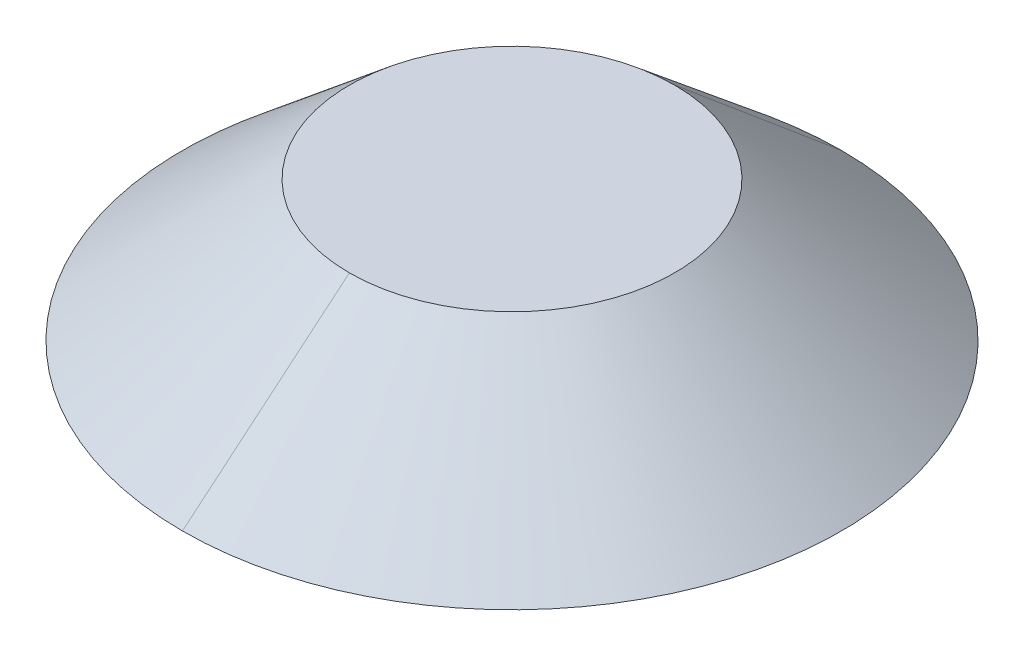
ISO-10303-21;
HEADER;
FILE_DESCRIPTION(('STEP AP214'),'2;1');
FILE_NAME('part.step','',(''),(''),'','','');
FILE_SCHEMA(('AUTOMOTIVE_DESIGN { 1 0 10303 214 1 1 1 1 }'));
ENDSEC;
DATA;
#1=APPLICATION_CONTEXT('core data for automotive mechanical design processes');
#2=APPLICATION_PROTOCOL_DEFINITION('international standard','automotive_design',2000,#1);
#3=PRODUCT_CONTEXT('',#1,'mechanical');
#4=PRODUCT('Part','Part','',(#3));
#5=PRODUCT_RELATED_PRODUCT_CATEGORY('part','',(#4));
#6=PRODUCT_DEFINITION_FORMATION('','',#4);
#7=PRODUCT_DEFINITION_CONTEXT('part definition',#1,'design');
#8=PRODUCT_DEFINITION('design','',#6,#7);
#9=PRODUCT_DEFINITION_SHAPE('','',#8);
#10=(LENGTH_UNIT() NAMED_UNIT(*) SI_UNIT(.MILLI.,.METRE.));
#11=(NAMED_UNIT(*) PLANE_ANGLE_UNIT() SI_UNIT($,.RADIAN.));
#12=(NAMED_UNIT(*) SI_UNIT($,.STERADIAN.) SOLID_ANGLE_UNIT());
#13=UNCERTAINTY_MEASURE_WITH_UNIT(LENGTH_MEASURE(1.E-05),#10,'distance_accuracy_value','');
#14=(GEOMETRIC_REPRESENTATION_CONTEXT(3) GLOBAL_UNCERTAINTY_ASSIGNED_CONTEXT((#13)) GLOBAL_UNIT_ASSIGNED_CONTEXT((#10,
#11,#12)) REPRESENTATION_CONTEXT('',''));
#15=CARTESIAN_POINT('',(0.,0.,0.));
#16=DIRECTION('',(0.,0.,1.));
#17=DIRECTION('',(1.,0.,0.));
#18=AXIS2_PLACEMENT_3D('',#15,#16,#17);
#19=CARTESIAN_POINT('',(0.,0.117222218475467,0.));
#20=DIRECTION('',(0.,-1.,0.));
#21=DIRECTION('',(0.,0.,-1.));
#22=AXIS2_PLACEMENT_3D('',#19,#20,#21);
#23=PLANE('',#22);
#24=CARTESIAN_POINT('',(0.,0.117222218475467,0.));
#25=DIRECTION('',(0.,-1.,0.));
#26=DIRECTION('',(0.,0.,-1.));
#27=AXIS2_PLACEMENT_3D('',#24,#25,#26);
#28=CIRCLE('',#27,2.413);
#29=CARTESIAN_POINT('',(0.,0.117222218475468,2.413));
#30=VERTEX_POINT('',#29);
#31=CARTESIAN_POINT('',(0.,0.117222218475467,-2.413));
#32=VERTEX_POINT('',#31);
#33=EDGE_CURVE('E11',#30,#32,#28,.T.);
#34=ORIENTED_EDGE('',*,*,#33,.F.);
#35=CARTESIAN_POINT('',(0.,0.117222218475467,0.));
#36=DIRECTION('',(0.,-1.,0.));
#37=DIRECTION('',(0.,0.,-1.));
#38=AXIS2_PLACEMENT_3D('',#35,#36,#37);
#39=CIRCLE('',#38,2.413);
#40=EDGE_CURVE('E25',#32,#30,#39,.T.);
#41=ORIENTED_EDGE('',*,*,#40,.F.);
#42=EDGE_LOOP('',(#34,#41));
#43=FACE_BOUND('',#42,.T.);
#44=ADVANCED_FACE('F17',(#43),#23,.F.);
#45=CARTESIAN_POINT('',(0.,0.117222218475467,0.));
#46=DIRECTION('',(0.,-1.,0.));
#47=DIRECTION('',(-1.,0.,0.));
#48=AXIS2_PLACEMENT_3D('',#45,#46,#47);
#49=CONICAL_SURFACE('',#48,2.413,0.872664625997163);
#50=DIRECTION('',(0.,-0.642787609686541,0.766044443118977));
#51=VECTOR('',#50,1.);
#52=CARTESIAN_POINT('',(0.,0.117222218475468,2.413));
#53=LINE('',#52,#51);
#54=CARTESIAN_POINT('',(0.,-1.96080801813507,4.8895));
#55=VERTEX_POINT('',#54);
#56=EDGE_CURVE('E282',#30,#55,#53,.T.);
#57=ORIENTED_EDGE('',*,*,#56,.T.);
#58=CARTESIAN_POINT('',(0.,-1.96080801813508,0.));
#59=DIRECTION('',(0.,-1.,0.));
#60=DIRECTION('',(0.,0.,-1.));
#61=AXIS2_PLACEMENT_3D('',#58,#59,#60);
#62=CIRCLE('',#61,4.8895);
#63=CARTESIAN_POINT('',(0.,-1.96080801813508,-4.8895));
#64=VERTEX_POINT('',#63);
#65=EDGE_CURVE('E277',#64,#55,#62,.T.);
#66=ORIENTED_EDGE('',*,*,#65,.F.);
#67=DIRECTION('',(0.,-0.642787609686541,-0.766044443118977));
#68=VECTOR('',#67,1.);
#69=CARTESIAN_POINT('',(0.,0.117222218475468,-2.413));
#70=LINE('',#69,#68);
#71=EDGE_CURVE('E272',#32,#64,#70,.T.);
#72=ORIENTED_EDGE('',*,*,#71,.F.);
#73=ORIENTED_EDGE('',*,*,#40,.T.);
#74=EDGE_LOOP('',(#57,#66,#72,#73));
#75=FACE_BOUND('',#74,.T.);
#76=ADVANCED_FACE('F291',(#75),#49,.T.);
#77=CARTESIAN_POINT('',(0.,0.117222218475467,0.));
#78=DIRECTION('',(0.,-1.,0.));
#79=DIRECTION('',(1.,0.,0.));
#80=AXIS2_PLACEMENT_3D('',#77,#78,#79);
#81=CONICAL_SURFACE('',#80,2.413,0.872664625997163);
#82=ORIENTED_EDGE('',*,*,#56,.F.);
#83=ORIENTED_EDGE('',*,*,#33,.T.);
#84=ORIENTED_EDGE('',*,*,#71,.T.);
#85=CARTESIAN_POINT('',(0.,-1.96080801813508,0.));
#86=DIRECTION('',(0.,-1.,0.));
#87=DIRECTION('',(0.,0.,-1.));
#88=AXIS2_PLACEMENT_3D('',#85,#86,#87);
#89=CIRCLE('',#88,4.8895);
#90=EDGE_CURVE('E267',#55,#64,#89,.T.);
#91=ORIENTED_EDGE('',*,*,#90,.F.);
#92=EDGE_LOOP('',(#82,#83,#84,#91));
#93=FACE_BOUND('',#92,.T.);
#94=ADVANCED_FACE('F294',(#93),#81,.T.);
#95=CARTESIAN_POINT('',(4.8895,-1.96080801813508,0.));
#96=DIRECTION('',(0.,1.,0.));
#97=DIRECTION('',(0.,0.,1.));
#98=AXIS2_PLACEMENT_3D('',#95,#96,#97);
#99=PLANE('',#98);
#100=DIRECTION('',(0.,0.,-1.));
#101=VECTOR('',#100,1.);
#102=CARTESIAN_POINT('',(2.58826,-1.96080801813508,0.));
#103=LINE('',#102,#101);
#104=CARTESIAN_POINT('',(2.58826,-1.96080801813508,0.52832));
#105=VERTEX_POINT('',#104);
#106=CARTESIAN_POINT('',(2.58826,-1.96080801813508,-0.52832));
#107=VERTEX_POINT('',#106);
#108=EDGE_CURVE('E263',#105,#107,#103,.T.);
#109=ORIENTED_EDGE('',*,*,#108,.T.);
#110=DIRECTION('',(1.,0.,0.));
#111=VECTOR('',#110,1.);
#112=CARTESIAN_POINT('',(0.78232,-1.96080801813508,-0.52832));
#113=LINE('',#112,#111);
#114=CARTESIAN_POINT('',(0.78232,-1.96080801813508,-0.52832));
#115=VERTEX_POINT('',#114);
#116=EDGE_CURVE('E258',#115,#107,#113,.T.);
#117=ORIENTED_EDGE('',*,*,#116,.F.);
#118=CARTESIAN_POINT('',(0.782320000000041,-1.96080801813508,-0.782320000000041));
#119=DIRECTION('',(0.,-1.,0.));
#120=DIRECTION('',(1.,0.,0.));
#121=AXIS2_PLACEMENT_3D('',#118,#119,#120);
#122=CIRCLE('',#121,0.254000000000041);
#123=CARTESIAN_POINT('',(0.52832,-1.96080801813508,-0.78232));
#124=VERTEX_POINT('',#123);
#125=EDGE_CURVE('E254',#115,#124,#122,.T.);
#126=ORIENTED_EDGE('',*,*,#125,.T.);
#127=DIRECTION('',(0.,0.,1.));
#128=VECTOR('',#127,1.);
#129=CARTESIAN_POINT('',(0.52832,-1.96080801813508,-2.58826));
#130=LINE('',#129,#128);
#131=CARTESIAN_POINT('',(0.52832,-1.96080801813508,-2.58826));
#132=VERTEX_POINT('',#131);
#133=EDGE_CURVE('E249',#132,#124,#130,.T.);
#134=ORIENTED_EDGE('',*,*,#133,.F.);
#135=DIRECTION('',(1.,0.,0.));
#136=VECTOR('',#135,1.);
#137=CARTESIAN_POINT('',(-0.52832,-1.96080801813508,-2.58826));
#138=LINE('',#137,#136);
#139=CARTESIAN_POINT('',(-0.52832,-1.96080801813508,-2.58826));
#140=VERTEX_POINT('',#139);
#141=EDGE_CURVE('E244',#140,#132,#138,.T.);
#142=ORIENTED_EDGE('',*,*,#141,.F.);
#143=DIRECTION('',(0.,0.,-1.));
#144=VECTOR('',#143,1.);
#145=CARTESIAN_POINT('',(-0.52832,-1.96080801813508,-0.78232));
#146=LINE('',#145,#144);
#147=CARTESIAN_POINT('',(-0.52832,-1.96080801813508,-0.78232));
#148=VERTEX_POINT('',#147);
#149=EDGE_CURVE('E239',#148,#140,#146,.T.);
#150=ORIENTED_EDGE('',*,*,#149,.F.);
#151=CARTESIAN_POINT('',(-0.782320000000041,-1.96080801813508,-0.782320000000041));
#152=DIRECTION('',(0.,-1.,0.));
#153=DIRECTION('',(1.,0.,0.));
#154=AXIS2_PLACEMENT_3D('',#151,#152,#153);
#155=CIRCLE('',#154,0.254000000000041);
#156=CARTESIAN_POINT('',(-0.78232,-1.96080801813508,-0.52832));
#157=VERTEX_POINT('',#156);
#158=EDGE_CURVE('E235',#148,#157,#155,.T.);
#159=ORIENTED_EDGE('',*,*,#158,.T.);
#160=DIRECTION('',(1.,0.,0.));
#161=VECTOR('',#160,1.);
#162=CARTESIAN_POINT('',(-2.58826,-1.96080801813508,-0.52832));
#163=LINE('',#162,#161);
#164=CARTESIAN_POINT('',(-2.58826,-1.96080801813508,-0.52832));
#165=VERTEX_POINT('',#164);
#166=EDGE_CURVE('E230',#165,#157,#163,.T.);
#167=ORIENTED_EDGE('',*,*,#166,.F.);
#168=DIRECTION('',(0.,0.,-1.));
#169=VECTOR('',#168,1.);
#170=CARTESIAN_POINT('',(-2.58826,-1.96080801813508,0.52832));
#171=LINE('',#170,#169);
#172=CARTESIAN_POINT('',(-2.58826,-1.96080801813508,0.52832));
#173=VERTEX_POINT('',#172);
#174=EDGE_CURVE('E225',#173,#165,#171,.T.);
#175=ORIENTED_EDGE('',*,*,#174,.F.);
#176=DIRECTION('',(-1.,0.,0.));
#177=VECTOR('',#176,1.);
#178=CARTESIAN_POINT('',(-0.78232,-1.96080801813508,0.52832));
#179=LINE('',#178,#177);
#180=CARTESIAN_POINT('',(-0.78232,-1.96080801813508,0.52832));
#181=VERTEX_POINT('',#180);
#182=EDGE_CURVE('E221',#181,#173,#179,.T.);
#183=ORIENTED_EDGE('',*,*,#182,.F.);
#184=CARTESIAN_POINT('',(-0.782320000000041,-1.96080801813508,0.782320000000041));
#185=DIRECTION('',(0.,-1.,0.));
#186=DIRECTION('',(1.,0.,0.));
#187=AXIS2_PLACEMENT_3D('',#184,#185,#186);
#188=CIRCLE('',#187,0.254000000000041);
#189=CARTESIAN_POINT('',(-0.52832,-1.96080801813508,0.78232));
#190=VERTEX_POINT('',#189);
#191=EDGE_CURVE('E153',#181,#190,#188,.T.);
#192=ORIENTED_EDGE('',*,*,#191,.T.);
#193=DIRECTION('',(0.,0.,-1.));
#194=VECTOR('',#193,1.);
#195=CARTESIAN_POINT('',(-0.52832,-1.96080801813508,2.58826));
#196=LINE('',#195,#194);
#197=CARTESIAN_POINT('',(-0.52832,-1.96080801813508,2.58826));
#198=VERTEX_POINT('',#197);
#199=EDGE_CURVE('E213',#198,#190,#196,.T.);
#200=ORIENTED_EDGE('',*,*,#199,.F.);
#201=DIRECTION('',(-1.,0.,0.));
#202=VECTOR('',#201,1.);
#203=CARTESIAN_POINT('',(0.52832,-1.96080801813508,2.58826));
#204=LINE('',#203,#202);
#205=CARTESIAN_POINT('',(0.52832,-1.96080801813508,2.58826));
#206=VERTEX_POINT('',#205);
#207=EDGE_CURVE('E208',#206,#198,#204,.T.);
#208=ORIENTED_EDGE('',*,*,#207,.F.);
#209=DIRECTION('',(0.,0.,1.));
#210=VECTOR('',#209,1.);
#211=CARTESIAN_POINT('',(0.52832,-1.96080801813508,0.78232));
#212=LINE('',#211,#210);
#213=CARTESIAN_POINT('',(0.52832,-1.96080801813508,0.78232));
#214=VERTEX_POINT('',#213);
#215=EDGE_CURVE('E203',#214,#206,#212,.T.);
#216=ORIENTED_EDGE('',*,*,#215,.F.);
#217=CARTESIAN_POINT('',(0.782320000000041,-1.96080801813508,0.782320000000041));
#218=DIRECTION('',(0.,-1.,0.));
#219=DIRECTION('',(1.,0.,0.));
#220=AXIS2_PLACEMENT_3D('',#217,#218,#219);
#221=CIRCLE('',#220,0.254000000000041);
#222=CARTESIAN_POINT('',(0.78232,-1.96080801813508,0.52832));
#223=VERTEX_POINT('',#222);
#224=EDGE_CURVE('E199',#214,#223,#221,.T.);
#225=ORIENTED_EDGE('',*,*,#224,.T.);
#226=DIRECTION('',(-1.,0.,0.));
#227=VECTOR('',#226,1.);
#228=CARTESIAN_POINT('',(2.58826,-1.96080801813508,0.52832));
#229=LINE('',#228,#227);
#230=EDGE_CURVE('E194',#105,#223,#229,.T.);
#231=ORIENTED_EDGE('',*,*,#230,.F.);
#232=EDGE_LOOP('',(#109,#117,#126,#134,#142,#150,#159,#167,#175,#183,#192,#200,#208,#216,#225,#231));
#233=FACE_BOUND('',#232,.T.);
#234=ORIENTED_EDGE('',*,*,#65,.T.);
#235=ORIENTED_EDGE('',*,*,#90,.T.);
#236=EDGE_LOOP('',(#234,#235));
#237=FACE_BOUND('',#236,.T.);
#238=ADVANCED_FACE('F296',(#233,#237),#99,.F.);
#239=CARTESIAN_POINT('',(2.58826,-1.04132801813507,0.52832));
#240=DIRECTION('',(0.,0.,1.));
#241=DIRECTION('',(1.,0.,0.));
#242=AXIS2_PLACEMENT_3D('',#239,#240,#241);
#243=PLANE('',#242);
#244=ORIENTED_EDGE('',*,*,#230,.T.);
#245=DIRECTION('',(0.,-1.,0.));
#246=VECTOR('',#245,1.);
#247=CARTESIAN_POINT('',(0.78232,-1.04132801813507,0.52832));
#248=LINE('',#247,#246);
#249=CARTESIAN_POINT('',(0.78232,-1.04132801813507,0.52832));
#250=VERTEX_POINT('',#249);
#251=EDGE_CURVE('E189',#250,#223,#248,.T.);
#252=ORIENTED_EDGE('',*,*,#251,.F.);
#253=DIRECTION('',(-1.,0.,0.));
#254=VECTOR('',#253,1.);
#255=CARTESIAN_POINT('',(2.58826,-1.04132801813507,0.52832));
#256=LINE('',#255,#254);
#257=CARTESIAN_POINT('',(2.58826,-1.04132801813507,0.52832));
#258=VERTEX_POINT('',#257);
#259=EDGE_CURVE('E184',#258,#250,#256,.T.);
#260=ORIENTED_EDGE('',*,*,#259,.F.);
#261=DIRECTION('',(0.,-1.,0.));
#262=VECTOR('',#261,1.);
#263=CARTESIAN_POINT('',(2.58826,-1.04132801813507,0.52832));
#264=LINE('',#263,#262);
#265=EDGE_CURVE('E179',#258,#105,#264,.T.);
#266=ORIENTED_EDGE('',*,*,#265,.T.);
#267=EDGE_LOOP('',(#244,#252,#260,#266));
#268=FACE_BOUND('',#267,.T.);
#269=ADVANCED_FACE('F298',(#268),#243,.F.);
#270=CARTESIAN_POINT('',(2.58826,-1.04132801813507,-0.52832));
#271=DIRECTION('',(1.,0.,0.));
#272=DIRECTION('',(0.,0.,-1.));
#273=AXIS2_PLACEMENT_3D('',#270,#271,#272);
#274=PLANE('',#273);
#275=DIRECTION('',(0.,-1.,0.));
#276=VECTOR('',#275,1.);
#277=CARTESIAN_POINT('',(2.58826,-1.04132801813507,-0.52832));
#278=LINE('',#277,#276);
#279=CARTESIAN_POINT('',(2.58826,-1.04132801813507,-0.52832));
#280=VERTEX_POINT('',#279);
#281=EDGE_CURVE('E166',#280,#107,#278,.T.);
#282=ORIENTED_EDGE('',*,*,#281,.T.);
#283=ORIENTED_EDGE('',*,*,#108,.F.);
#284=ORIENTED_EDGE('',*,*,#265,.F.);
#285=DIRECTION('',(0.,0.,1.));
#286=VECTOR('',#285,1.);
#287=CARTESIAN_POINT('',(2.58826,-1.04132801813507,-0.52832));
#288=LINE('',#287,#286);
#289=EDGE_CURVE('E162',#280,#258,#288,.T.);
#290=ORIENTED_EDGE('',*,*,#289,.F.);
#291=EDGE_LOOP('',(#282,#283,#284,#290));
#292=FACE_BOUND('',#291,.T.);
#293=ADVANCED_FACE('F306',(#292),#274,.F.);
#294=CARTESIAN_POINT('',(-0.782320000000041,-1.04132801813507,-0.782320000000041));
#295=DIRECTION('',(0.,-1.,0.));
#296=DIRECTION('',(0.,0.,-1.));
#297=AXIS2_PLACEMENT_3D('',#294,#295,#296);
#298=PLANE('',#297);
#299=DIRECTION('',(-1.,0.,0.));
#300=VECTOR('',#299,1.);
#301=CARTESIAN_POINT('',(-0.78232,-1.04132801813507,0.52832));
#302=LINE('',#301,#300);
#303=CARTESIAN_POINT('',(-0.78232,-1.04132801813507,0.52832));
#304=VERTEX_POINT('',#303);
#305=CARTESIAN_POINT('',(-2.58826,-1.04132801813507,0.52832));
#306=VERTEX_POINT('',#305);
#307=EDGE_CURVE('E141',#304,#306,#302,.T.);
#308=ORIENTED_EDGE('',*,*,#307,.T.);
#309=DIRECTION('',(0.,0.,-1.));
#310=VECTOR('',#309,1.);
#311=CARTESIAN_POINT('',(-2.58826,-1.04132801813507,0.52832));
#312=LINE('',#311,#310);
#313=CARTESIAN_POINT('',(-2.58826,-1.04132801813507,-0.52832));
#314=VERTEX_POINT('',#313);
#315=EDGE_CURVE('E163',#306,#314,#312,.T.);
#316=ORIENTED_EDGE('',*,*,#315,.T.);
#317=DIRECTION('',(1.,0.,0.));
#318=VECTOR('',#317,1.);
#319=CARTESIAN_POINT('',(-2.58826,-1.04132801813507,-0.52832));
#320=LINE('',#319,#318);
#321=CARTESIAN_POINT('',(-0.78232,-1.04132801813507,-0.52832));
#322=VERTEX_POINT('',#321);
#323=EDGE_CURVE('E168',#314,#322,#320,.T.);
#324=ORIENTED_EDGE('',*,*,#323,.T.);
#325=CARTESIAN_POINT('',(-0.782320000000041,-1.04132801813507,-0.782320000000041));
#326=DIRECTION('',(0.,-1.,0.));
#327=DIRECTION('',(1.,0.,0.));
#328=AXIS2_PLACEMENT_3D('',#325,#326,#327);
#329=CIRCLE('',#328,0.254000000000041);
#330=CARTESIAN_POINT('',(-0.52832,-1.04132801813507,-0.78232));
#331=VERTEX_POINT('',#330);
#332=EDGE_CURVE('E580',#331,#322,#329,.T.);
#333=ORIENTED_EDGE('',*,*,#332,.F.);
#334=DIRECTION('',(0.,0.,-1.));
#335=VECTOR('',#334,1.);
#336=CARTESIAN_POINT('',(-0.52832,-1.04132801813507,-0.78232));
#337=LINE('',#336,#335);
#338=CARTESIAN_POINT('',(-0.52832,-1.04132801813507,-2.58826));
#339=VERTEX_POINT('',#338);
#340=EDGE_CURVE('E576',#331,#339,#337,.T.);
#341=ORIENTED_EDGE('',*,*,#340,.T.);
#342=DIRECTION('',(1.,0.,0.));
#343=VECTOR('',#342,1.);
#344=CARTESIAN_POINT('',(-0.52832,-1.04132801813507,-2.58826));
#345=LINE('',#344,#343);
#346=CARTESIAN_POINT('',(0.52832,-1.04132801813507,-2.58826));
#347=VERTEX_POINT('',#346);
#348=EDGE_CURVE('E572',#339,#347,#345,.T.);
#349=ORIENTED_EDGE('',*,*,#348,.T.);
#350=DIRECTION('',(0.,0.,1.));
#351=VECTOR('',#350,1.);
#352=CARTESIAN_POINT('',(0.52832,-1.04132801813507,-2.58826));
#353=LINE('',#352,#351);
#354=CARTESIAN_POINT('',(0.52832,-1.04132801813507,-0.78232));
#355=VERTEX_POINT('',#354);
#356=EDGE_CURVE('E559',#347,#355,#353,.T.);
#357=ORIENTED_EDGE('',*,*,#356,.T.);
#358=CARTESIAN_POINT('',(0.782320000000041,-1.04132801813507,-0.782320000000041));
#359=DIRECTION('',(0.,-1.,0.));
#360=DIRECTION('',(1.,0.,0.));
#361=AXIS2_PLACEMENT_3D('',#358,#359,#360);
#362=CIRCLE('',#361,0.254000000000041);
#363=CARTESIAN_POINT('',(0.78232,-1.04132801813507,-0.52832));
#364=VERTEX_POINT('',#363);
#365=EDGE_CURVE('E556',#364,#355,#362,.T.);
#366=ORIENTED_EDGE('',*,*,#365,.F.);
#367=DIRECTION('',(1.,0.,0.));
#368=VECTOR('',#367,1.);
#369=CARTESIAN_POINT('',(0.78232,-1.04132801813507,-0.52832));
#370=LINE('',#369,#368);
#371=EDGE_CURVE('E554',#364,#280,#370,.T.);
#372=ORIENTED_EDGE('',*,*,#371,.T.);
#373=ORIENTED_EDGE('',*,*,#289,.T.);
#374=ORIENTED_EDGE('',*,*,#259,.T.);
#375=CARTESIAN_POINT('',(0.782320000000041,-1.04132801813507,0.782320000000041));
#376=DIRECTION('',(0.,-1.,0.));
#377=DIRECTION('',(1.,0.,0.));
#378=AXIS2_PLACEMENT_3D('',#375,#376,#377);
#379=CIRCLE('',#378,0.254000000000041);
#380=CARTESIAN_POINT('',(0.52832,-1.04132801813507,0.78232));
#381=VERTEX_POINT('',#380);
#382=EDGE_CURVE('E557',#381,#250,#379,.T.);
#383=ORIENTED_EDGE('',*,*,#382,.F.);
#384=DIRECTION('',(0.,0.,1.));
#385=VECTOR('',#384,1.);
#386=CARTESIAN_POINT('',(0.52832,-1.04132801813507,0.78232));
#387=LINE('',#386,#385);
#388=CARTESIAN_POINT('',(0.52832,-1.04132801813507,2.58826));
#389=VERTEX_POINT('',#388);
#390=EDGE_CURVE('E562',#381,#389,#387,.T.);
#391=ORIENTED_EDGE('',*,*,#390,.T.);
#392=DIRECTION('',(-1.,0.,0.));
#393=VECTOR('',#392,1.);
#394=CARTESIAN_POINT('',(0.52832,-1.04132801813507,2.58826));
#395=LINE('',#394,#393);
#396=CARTESIAN_POINT('',(-0.52832,-1.04132801813507,2.58826));
#397=VERTEX_POINT('',#396);
#398=EDGE_CURVE('E659',#389,#397,#395,.T.);
#399=ORIENTED_EDGE('',*,*,#398,.T.);
#400=DIRECTION('',(0.,0.,-1.));
#401=VECTOR('',#400,1.);
#402=CARTESIAN_POINT('',(-0.52832,-1.04132801813507,2.58826));
#403=LINE('',#402,#401);
#404=CARTESIAN_POINT('',(-0.52832,-1.04132801813507,0.78232));
#405=VERTEX_POINT('',#404);
#406=EDGE_CURVE('E144',#397,#405,#403,.T.);
#407=ORIENTED_EDGE('',*,*,#406,.T.);
#408=CARTESIAN_POINT('',(-0.782320000000041,-1.04132801813507,0.782320000000041));
#409=DIRECTION('',(0.,-1.,0.));
#410=DIRECTION('',(1.,0.,0.));
#411=AXIS2_PLACEMENT_3D('',#408,#409,#410);
#412=CIRCLE('',#411,0.254000000000041);
#413=EDGE_CURVE('E137',#304,#405,#412,.T.);
#414=ORIENTED_EDGE('',*,*,#413,.F.);
#415=EDGE_LOOP('',(#308,#316,#324,#333,#341,#349,#357,#366,#372,#373,#374,#383,#391,#399,#407,#414));
#416=FACE_BOUND('',#415,.T.);
#417=ADVANCED_FACE('F139',(#416),#298,.T.);
#418=CARTESIAN_POINT('',(-0.782320000000041,-1.04132801813507,0.782320000000041));
#419=DIRECTION('',(0.,-1.,0.));
#420=DIRECTION('',(-0.707106781186604,0.,0.707106781186491));
#421=AXIS2_PLACEMENT_3D('',#418,#419,#420);
#422=CYLINDRICAL_SURFACE('',#421,0.254000000000041);
#423=ORIENTED_EDGE('',*,*,#191,.F.);
#424=DIRECTION('',(0.,-1.,0.));
#425=VECTOR('',#424,1.);
#426=CARTESIAN_POINT('',(-0.78232,-1.04132801813507,0.52832));
#427=LINE('',#426,#425);
#428=EDGE_CURVE('E148',#304,#181,#427,.T.);
#429=ORIENTED_EDGE('',*,*,#428,.F.);
#430=ORIENTED_EDGE('',*,*,#413,.T.);
#431=DIRECTION('',(0.,-1.,0.));
#432=VECTOR('',#431,1.);
#433=CARTESIAN_POINT('',(-0.52832,-1.04132801813507,0.78232));
#434=LINE('',#433,#432);
#435=EDGE_CURVE('E156',#405,#190,#434,.T.);
#436=ORIENTED_EDGE('',*,*,#435,.T.);
#437=EDGE_LOOP('',(#423,#429,#430,#436));
#438=FACE_BOUND('',#437,.T.);
#439=ADVANCED_FACE('F152',(#438),#422,.T.);
#440=CARTESIAN_POINT('',(-0.52832,-1.04132801813507,2.58826));
#441=DIRECTION('',(-1.,0.,0.));
#442=DIRECTION('',(0.,0.,1.));
#443=AXIS2_PLACEMENT_3D('',#440,#441,#442);
#444=PLANE('',#443);
#445=ORIENTED_EDGE('',*,*,#199,.T.);
#446=ORIENTED_EDGE('',*,*,#435,.F.);
#447=ORIENTED_EDGE('',*,*,#406,.F.);
#448=DIRECTION('',(0.,-1.,0.));
#449=VECTOR('',#448,1.);
#450=CARTESIAN_POINT('',(-0.52832,-1.04132801813507,2.58826));
#451=LINE('',#450,#449);
#452=EDGE_CURVE('E644',#397,#198,#451,.T.);
#453=ORIENTED_EDGE('',*,*,#452,.T.);
#454=EDGE_LOOP('',(#445,#446,#447,#453));
#455=FACE_BOUND('',#454,.T.);
#456=ADVANCED_FACE('F366',(#455),#444,.F.);
#457=CARTESIAN_POINT('',(0.52832,-1.04132801813507,2.58826));
#458=DIRECTION('',(0.,0.,1.));
#459=DIRECTION('',(1.,0.,0.));
#460=AXIS2_PLACEMENT_3D('',#457,#458,#459);
#461=PLANE('',#460);
#462=ORIENTED_EDGE('',*,*,#207,.T.);
#463=ORIENTED_EDGE('',*,*,#452,.F.);
#464=ORIENTED_EDGE('',*,*,#398,.F.);
#465=DIRECTION('',(0.,-1.,0.));
#466=VECTOR('',#465,1.);
#467=CARTESIAN_POINT('',(0.52832,-1.04132801813507,2.58826));
#468=LINE('',#467,#466);
#469=EDGE_CURVE('E639',#389,#206,#468,.T.);
#470=ORIENTED_EDGE('',*,*,#469,.T.);
#471=EDGE_LOOP('',(#462,#463,#464,#470));
#472=FACE_BOUND('',#471,.T.);
#473=ADVANCED_FACE('F376',(#472),#461,.F.);
#474=CARTESIAN_POINT('',(0.52832,-1.04132801813507,0.78232));
#475=DIRECTION('',(1.,0.,0.));
#476=DIRECTION('',(0.,0.,-1.));
#477=AXIS2_PLACEMENT_3D('',#474,#475,#476);
#478=PLANE('',#477);
#479=ORIENTED_EDGE('',*,*,#215,.T.);
#480=ORIENTED_EDGE('',*,*,#469,.F.);
#481=ORIENTED_EDGE('',*,*,#390,.F.);
#482=DIRECTION('',(0.,-1.,0.));
#483=VECTOR('',#482,1.);
#484=CARTESIAN_POINT('',(0.52832,-1.04132801813507,0.78232));
#485=LINE('',#484,#483);
#486=EDGE_CURVE('E634',#381,#214,#485,.T.);
#487=ORIENTED_EDGE('',*,*,#486,.T.);
#488=EDGE_LOOP('',(#479,#480,#481,#487));
#489=FACE_BOUND('',#488,.T.);
#490=ADVANCED_FACE('F387',(#489),#478,.F.);
#491=CARTESIAN_POINT('',(0.782320000000041,-1.04132801813507,0.782320000000041));
#492=DIRECTION('',(0.,-1.,0.));
#493=DIRECTION('',(0.707106781186548,0.,0.707106781186547));
#494=AXIS2_PLACEMENT_3D('',#491,#492,#493);
#495=CYLINDRICAL_SURFACE('',#494,0.254000000000041);
#496=ORIENTED_EDGE('',*,*,#224,.F.);
#497=ORIENTED_EDGE('',*,*,#486,.F.);
#498=ORIENTED_EDGE('',*,*,#382,.T.);
#499=ORIENTED_EDGE('',*,*,#251,.T.);
#500=EDGE_LOOP('',(#496,#497,#498,#499));
#501=FACE_BOUND('',#500,.T.);
#502=ADVANCED_FACE('F398',(#501),#495,.T.);
#503=CARTESIAN_POINT('',(-0.78232,-1.04132801813507,0.52832));
#504=DIRECTION('',(0.,0.,1.));
#505=DIRECTION('',(1.,0.,0.));
#506=AXIS2_PLACEMENT_3D('',#503,#504,#505);
#507=PLANE('',#506);
#508=ORIENTED_EDGE('',*,*,#182,.T.);
#509=DIRECTION('',(0.,-1.,0.));
#510=VECTOR('',#509,1.);
#511=CARTESIAN_POINT('',(-2.58826,-1.04132801813507,0.52832));
#512=LINE('',#511,#510);
#513=EDGE_CURVE('E160',#306,#173,#512,.T.);
#514=ORIENTED_EDGE('',*,*,#513,.F.);
#515=ORIENTED_EDGE('',*,*,#307,.F.);
#516=ORIENTED_EDGE('',*,*,#428,.T.);
#517=EDGE_LOOP('',(#508,#514,#515,#516));
#518=FACE_BOUND('',#517,.T.);
#519=ADVANCED_FACE('F158',(#518),#507,.F.);
#520=CARTESIAN_POINT('',(-2.58826,-1.04132801813507,0.52832));
#521=DIRECTION('',(-1.,0.,0.));
#522=DIRECTION('',(0.,0.,1.));
#523=AXIS2_PLACEMENT_3D('',#520,#521,#522);
#524=PLANE('',#523);
#525=ORIENTED_EDGE('',*,*,#174,.T.);
#526=DIRECTION('',(0.,-1.,0.));
#527=VECTOR('',#526,1.);
#528=CARTESIAN_POINT('',(-2.58826,-1.04132801813507,-0.52832));
#529=LINE('',#528,#527);
#530=EDGE_CURVE('E597',#314,#165,#529,.T.);
#531=ORIENTED_EDGE('',*,*,#530,.F.);
#532=ORIENTED_EDGE('',*,*,#315,.F.);
#533=ORIENTED_EDGE('',*,*,#513,.T.);
#534=EDGE_LOOP('',(#525,#531,#532,#533));
#535=FACE_BOUND('',#534,.T.);
#536=ADVANCED_FACE('F419',(#535),#524,.F.);
#537=CARTESIAN_POINT('',(-2.58826,-1.04132801813507,-0.52832));
#538=DIRECTION('',(0.,0.,-1.));
#539=DIRECTION('',(-1.,0.,0.));
#540=AXIS2_PLACEMENT_3D('',#537,#538,#539);
#541=PLANE('',#540);
#542=ORIENTED_EDGE('',*,*,#166,.T.);
#543=DIRECTION('',(0.,-1.,0.));
#544=VECTOR('',#543,1.);
#545=CARTESIAN_POINT('',(-0.78232,-1.04132801813507,-0.52832));
#546=LINE('',#545,#544);
#547=EDGE_CURVE('E595',#322,#157,#546,.T.);
#548=ORIENTED_EDGE('',*,*,#547,.F.);
#549=ORIENTED_EDGE('',*,*,#323,.F.);
#550=ORIENTED_EDGE('',*,*,#530,.T.);
#551=EDGE_LOOP('',(#542,#548,#549,#550));
#552=FACE_BOUND('',#551,.T.);
#553=ADVANCED_FACE('F429',(#552),#541,.F.);
#554=CARTESIAN_POINT('',(-0.782320000000041,-1.04132801813507,-0.782320000000041));
#555=DIRECTION('',(0.,-1.,0.));
#556=DIRECTION('',(-0.707106781186548,0.,-0.707106781186548));
#557=AXIS2_PLACEMENT_3D('',#554,#555,#556);
#558=CYLINDRICAL_SURFACE('',#557,0.254000000000041);
#559=ORIENTED_EDGE('',*,*,#158,.F.);
#560=DIRECTION('',(0.,-1.,0.));
#561=VECTOR('',#560,1.);
#562=CARTESIAN_POINT('',(-0.52832,-1.04132801813507,-0.78232));
#563=LINE('',#562,#561);
#564=EDGE_CURVE('E598',#331,#148,#563,.T.);
#565=ORIENTED_EDGE('',*,*,#564,.F.);
#566=ORIENTED_EDGE('',*,*,#332,.T.);
#567=ORIENTED_EDGE('',*,*,#547,.T.);
#568=EDGE_LOOP('',(#559,#565,#566,#567));
#569=FACE_BOUND('',#568,.T.);
#570=ADVANCED_FACE('F440',(#569),#558,.T.);
#571=CARTESIAN_POINT('',(-0.52832,-1.04132801813507,-0.78232));
#572=DIRECTION('',(-1.,0.,0.));
#573=DIRECTION('',(0.,0.,1.));
#574=AXIS2_PLACEMENT_3D('',#571,#572,#573);
#575=PLANE('',#574);
#576=ORIENTED_EDGE('',*,*,#149,.T.);
#577=DIRECTION('',(0.,-1.,0.));
#578=VECTOR('',#577,1.);
#579=CARTESIAN_POINT('',(-0.52832,-1.04132801813507,-2.58826));
#580=LINE('',#579,#578);
#581=EDGE_CURVE('E602',#339,#140,#580,.T.);
#582=ORIENTED_EDGE('',*,*,#581,.F.);
#583=ORIENTED_EDGE('',*,*,#340,.F.);
#584=ORIENTED_EDGE('',*,*,#564,.T.);
#585=EDGE_LOOP('',(#576,#582,#583,#584));
#586=FACE_BOUND('',#585,.T.);
#587=ADVANCED_FACE('F451',(#586),#575,.F.);
#588=CARTESIAN_POINT('',(-0.52832,-1.04132801813507,-2.58826));
#589=DIRECTION('',(0.,0.,-1.));
#590=DIRECTION('',(-1.,0.,0.));
#591=AXIS2_PLACEMENT_3D('',#588,#589,#590);
#592=PLANE('',#591);
#593=ORIENTED_EDGE('',*,*,#141,.T.);
#594=DIRECTION('',(0.,-1.,0.));
#595=VECTOR('',#594,1.);
#596=CARTESIAN_POINT('',(0.52832,-1.04132801813507,-2.58826));
#597=LINE('',#596,#595);
#598=EDGE_CURVE('E611',#347,#132,#597,.T.);
#599=ORIENTED_EDGE('',*,*,#598,.F.);
#600=ORIENTED_EDGE('',*,*,#348,.F.);
#601=ORIENTED_EDGE('',*,*,#581,.T.);
#602=EDGE_LOOP('',(#593,#599,#600,#601));
#603=FACE_BOUND('',#602,.T.);
#604=ADVANCED_FACE('F462',(#603),#592,.F.);
#605=CARTESIAN_POINT('',(0.52832,-1.04132801813507,-2.58826));
#606=DIRECTION('',(1.,0.,0.));
#607=DIRECTION('',(0.,0.,-1.));
#608=AXIS2_PLACEMENT_3D('',#605,#606,#607);
#609=PLANE('',#608);
#610=ORIENTED_EDGE('',*,*,#133,.T.);
#611=DIRECTION('',(0.,-1.,0.));
#612=VECTOR('',#611,1.);
#613=CARTESIAN_POINT('',(0.52832,-1.04132801813507,-0.78232));
#614=LINE('',#613,#612);
#615=EDGE_CURVE('E612',#355,#124,#614,.T.);
#616=ORIENTED_EDGE('',*,*,#615,.F.);
#617=ORIENTED_EDGE('',*,*,#356,.F.);
#618=ORIENTED_EDGE('',*,*,#598,.T.);
#619=EDGE_LOOP('',(#610,#616,#617,#618));
#620=FACE_BOUND('',#619,.T.);
#621=ADVANCED_FACE('F473',(#620),#609,.F.);
#622=CARTESIAN_POINT('',(0.782320000000041,-1.04132801813507,-0.782320000000041));
#623=DIRECTION('',(0.,-1.,0.));
#624=DIRECTION('',(0.707106781186547,0.,-0.707106781186548));
#625=AXIS2_PLACEMENT_3D('',#622,#623,#624);
#626=CYLINDRICAL_SURFACE('',#625,0.254000000000041);
#627=ORIENTED_EDGE('',*,*,#125,.F.);
#628=DIRECTION('',(0.,-1.,0.));
#629=VECTOR('',#628,1.);
#630=CARTESIAN_POINT('',(0.78232,-1.04132801813507,-0.52832));
#631=LINE('',#630,#629);
#632=EDGE_CURVE('E548',#364,#115,#631,.T.);
#633=ORIENTED_EDGE('',*,*,#632,.F.);
#634=ORIENTED_EDGE('',*,*,#365,.T.);
#635=ORIENTED_EDGE('',*,*,#615,.T.);
#636=EDGE_LOOP('',(#627,#633,#634,#635));
#637=FACE_BOUND('',#636,.T.);
#638=ADVANCED_FACE('F484',(#637),#626,.T.);
#639=CARTESIAN_POINT('',(0.78232,-1.04132801813507,-0.52832));
#640=DIRECTION('',(0.,0.,-1.));
#641=DIRECTION('',(-1.,0.,0.));
#642=AXIS2_PLACEMENT_3D('',#639,#640,#641);
#643=PLANE('',#642);
#644=ORIENTED_EDGE('',*,*,#116,.T.);
#645=ORIENTED_EDGE('',*,*,#281,.F.);
#646=ORIENTED_EDGE('',*,*,#371,.F.);
#647=ORIENTED_EDGE('',*,*,#632,.T.);
#648=EDGE_LOOP('',(#644,#645,#646,#647));
#649=FACE_BOUND('',#648,.T.);
#650=ADVANCED_FACE('F495',(#649),#643,.F.);
#651=CLOSED_SHELL('',(#44,#76,#94,#238,#269,#293,#417,#439,#456,#473,#490,#502,#519,#536,#553,
#570,#587,#604,#621,#638,#650));
#652=MANIFOLD_SOLID_BREP('B1',#651);
#653=ADVANCED_BREP_SHAPE_REPRESENTATION('',(#18,#652),#14);
#654=SHAPE_DEFINITION_REPRESENTATION(#9,#653);
ENDSEC;
END-ISO-10303-21;
